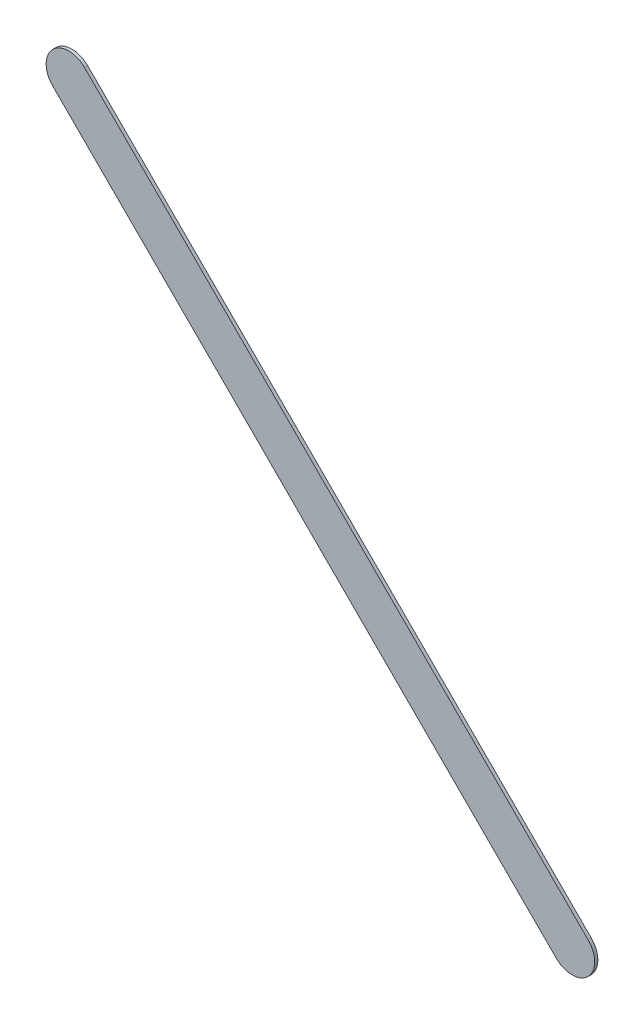
ISO-10303-21;
HEADER;
FILE_DESCRIPTION(('STEP AP214'),'2;1');
FILE_NAME('part.step','',(''),(''),'','','');
FILE_SCHEMA(('AUTOMOTIVE_DESIGN { 1 0 10303 214 1 1 1 1 }'));
ENDSEC;
DATA;
#1=APPLICATION_CONTEXT('core data for automotive mechanical design processes');
#2=APPLICATION_PROTOCOL_DEFINITION('international standard','automotive_design',2000,#1);
#3=PRODUCT_CONTEXT('',#1,'mechanical');
#4=PRODUCT('Part','Part','',(#3));
#5=PRODUCT_RELATED_PRODUCT_CATEGORY('part','',(#4));
#6=PRODUCT_DEFINITION_FORMATION('','',#4);
#7=PRODUCT_DEFINITION_CONTEXT('part definition',#1,'design');
#8=PRODUCT_DEFINITION('design','',#6,#7);
#9=PRODUCT_DEFINITION_SHAPE('','',#8);
#10=(LENGTH_UNIT() NAMED_UNIT(*) SI_UNIT(.MILLI.,.METRE.));
#11=(NAMED_UNIT(*) PLANE_ANGLE_UNIT() SI_UNIT($,.RADIAN.));
#12=(NAMED_UNIT(*) SI_UNIT($,.STERADIAN.) SOLID_ANGLE_UNIT());
#13=UNCERTAINTY_MEASURE_WITH_UNIT(LENGTH_MEASURE(1.E-05),#10,'distance_accuracy_value','');
#14=(GEOMETRIC_REPRESENTATION_CONTEXT(3) GLOBAL_UNCERTAINTY_ASSIGNED_CONTEXT((#13)) GLOBAL_UNIT_ASSIGNED_CONTEXT((#10,
#11,#12)) REPRESENTATION_CONTEXT('',''));
#15=CARTESIAN_POINT('',(0.,0.,0.));
#16=DIRECTION('',(0.,0.,1.));
#17=DIRECTION('',(1.,0.,0.));
#18=AXIS2_PLACEMENT_3D('',#15,#16,#17);
#19=CARTESIAN_POINT('',(158.164776,-89.739223,0.));
#20=DIRECTION('',(0.,0.,1.));
#21=DIRECTION('',(1.,0.,0.));
#22=AXIS2_PLACEMENT_3D('',#19,#20,#21);
#23=PLANE('',#22);
#24=DIRECTION('',(-0.707106781186548,0.707106781186548,0.));
#25=VECTOR('',#24,1.);
#26=CARTESIAN_POINT('',(158.164776,-89.739223,0.));
#27=LINE('',#26,#25);
#28=CARTESIAN_POINT('',(158.164776,-89.739223,0.));
#29=VERTEX_POINT('',#28);
#30=CARTESIAN_POINT('',(152.576776,-84.151223,0.));
#31=VERTEX_POINT('',#30);
#32=EDGE_CURVE('E82',#29,#31,#27,.T.);
#33=ORIENTED_EDGE('',*,*,#32,.T.);
#34=CARTESIAN_POINT('',(152.3999995,-84.3279995,0.));
#35=DIRECTION('',(0.,0.,1.));
#36=DIRECTION('',(0.707106781186548,0.707106781186548,0.));
#37=AXIS2_PLACEMENT_3D('',#34,#35,#36);
#38=CIRCLE('',#37,0.249999723809);
#39=CARTESIAN_POINT('',(152.223223,-84.504776,0.));
#40=VERTEX_POINT('',#39);
#41=EDGE_CURVE('E106',#31,#40,#38,.T.);
#42=ORIENTED_EDGE('',*,*,#41,.T.);
#43=DIRECTION('',(0.707106781186548,-0.707106781186548,0.));
#44=VECTOR('',#43,1.);
#45=CARTESIAN_POINT('',(152.223223,-84.504776,0.));
#46=LINE('',#45,#44);
#47=CARTESIAN_POINT('',(157.811223,-90.092776,0.));
#48=VERTEX_POINT('',#47);
#49=EDGE_CURVE('E74',#40,#48,#46,.T.);
#50=ORIENTED_EDGE('',*,*,#49,.T.);
#51=CARTESIAN_POINT('',(157.9879995,-89.9159995,0.));
#52=DIRECTION('',(0.,0.,1.));
#53=DIRECTION('',(-0.707106781186548,-0.707106781186548,0.));
#54=AXIS2_PLACEMENT_3D('',#51,#52,#53);
#55=CIRCLE('',#54,0.249999723809);
#56=EDGE_CURVE('E11',#48,#29,#55,.T.);
#57=ORIENTED_EDGE('',*,*,#56,.T.);
#58=EDGE_LOOP('',(#33,#42,#50,#57));
#59=FACE_BOUND('',#58,.T.);
#60=ADVANCED_FACE('F17',(#59),#23,.T.);
#61=CARTESIAN_POINT('',(158.164776,-89.739223,-0.035));
#62=DIRECTION('',(0.,0.,1.));
#63=DIRECTION('',(1.,0.,0.));
#64=AXIS2_PLACEMENT_3D('',#61,#62,#63);
#65=PLANE('',#64);
#66=CARTESIAN_POINT('',(157.9879995,-89.9159995,-0.035));
#67=DIRECTION('',(0.,0.,1.));
#68=DIRECTION('',(-0.707106781186548,-0.707106781186548,0.));
#69=AXIS2_PLACEMENT_3D('',#66,#67,#68);
#70=CIRCLE('',#69,0.249999723809);
#71=CARTESIAN_POINT('',(157.811223,-90.092776,-0.035));
#72=VERTEX_POINT('',#71);
#73=CARTESIAN_POINT('',(158.164776,-89.739223,-0.035));
#74=VERTEX_POINT('',#73);
#75=EDGE_CURVE('E25',#72,#74,#70,.T.);
#76=ORIENTED_EDGE('',*,*,#75,.F.);
#77=DIRECTION('',(0.707106781186548,-0.707106781186548,0.));
#78=VECTOR('',#77,1.);
#79=CARTESIAN_POINT('',(152.223223,-84.504776,-0.035));
#80=LINE('',#79,#78);
#81=CARTESIAN_POINT('',(152.223223,-84.504776,-0.035));
#82=VERTEX_POINT('',#81);
#83=EDGE_CURVE('E110',#82,#72,#80,.T.);
#84=ORIENTED_EDGE('',*,*,#83,.F.);
#85=CARTESIAN_POINT('',(152.3999995,-84.3279995,-0.035));
#86=DIRECTION('',(0.,0.,1.));
#87=DIRECTION('',(0.707106781186548,0.707106781186548,0.));
#88=AXIS2_PLACEMENT_3D('',#85,#86,#87);
#89=CIRCLE('',#88,0.249999723809);
#90=CARTESIAN_POINT('',(152.576776,-84.151223,-0.035));
#91=VERTEX_POINT('',#90);
#92=EDGE_CURVE('E84',#91,#82,#89,.T.);
#93=ORIENTED_EDGE('',*,*,#92,.F.);
#94=DIRECTION('',(-0.707106781186548,0.707106781186548,0.));
#95=VECTOR('',#94,1.);
#96=CARTESIAN_POINT('',(158.164776,-89.739223,-0.035));
#97=LINE('',#96,#95);
#98=EDGE_CURVE('E80',#74,#91,#97,.T.);
#99=ORIENTED_EDGE('',*,*,#98,.F.);
#100=EDGE_LOOP('',(#76,#84,#93,#99));
#101=FACE_BOUND('',#100,.T.);
#102=ADVANCED_FACE('F86',(#101),#65,.F.);
#103=CARTESIAN_POINT('',(157.9879995,-89.9159995,-0.035));
#104=DIRECTION('',(0.,0.,-1.));
#105=DIRECTION('',(-0.707106781186548,-0.707106781186548,0.));
#106=AXIS2_PLACEMENT_3D('',#103,#104,#105);
#107=CYLINDRICAL_SURFACE('',#106,0.249999723809);
#108=ORIENTED_EDGE('',*,*,#75,.T.);
#109=DIRECTION('',(0.,0.,1.));
#110=VECTOR('',#109,1.);
#111=CARTESIAN_POINT('',(158.164776,-89.739223,-0.035));
#112=LINE('',#111,#110);
#113=EDGE_CURVE('E68',#74,#29,#112,.T.);
#114=ORIENTED_EDGE('',*,*,#113,.T.);
#115=ORIENTED_EDGE('',*,*,#56,.F.);
#116=DIRECTION('',(0.,0.,1.));
#117=VECTOR('',#116,1.);
#118=CARTESIAN_POINT('',(157.811223,-90.092776,-0.035));
#119=LINE('',#118,#117);
#120=EDGE_CURVE('E71',#72,#48,#119,.T.);
#121=ORIENTED_EDGE('',*,*,#120,.F.);
#122=EDGE_LOOP('',(#108,#114,#115,#121));
#123=FACE_BOUND('',#122,.T.);
#124=ADVANCED_FACE('F67',(#123),#107,.T.);
#125=CARTESIAN_POINT('',(152.223223,-84.504776,-0.035));
#126=DIRECTION('',(0.707106781186548,0.707106781186548,0.));
#127=DIRECTION('',(0.,0.,-1.));
#128=AXIS2_PLACEMENT_3D('',#125,#126,#127);
#129=PLANE('',#128);
#130=ORIENTED_EDGE('',*,*,#83,.T.);
#131=ORIENTED_EDGE('',*,*,#120,.T.);
#132=ORIENTED_EDGE('',*,*,#49,.F.);
#133=DIRECTION('',(0.,0.,1.));
#134=VECTOR('',#133,1.);
#135=CARTESIAN_POINT('',(152.223223,-84.504776,-0.035));
#136=LINE('',#135,#134);
#137=EDGE_CURVE('E102',#82,#40,#136,.T.);
#138=ORIENTED_EDGE('',*,*,#137,.F.);
#139=EDGE_LOOP('',(#130,#131,#132,#138));
#140=FACE_BOUND('',#139,.T.);
#141=ADVANCED_FACE('F120',(#140),#129,.F.);
#142=CARTESIAN_POINT('',(152.3999995,-84.3279995,-0.035));
#143=DIRECTION('',(0.,0.,-1.));
#144=DIRECTION('',(0.707106781186548,0.707106781186548,0.));
#145=AXIS2_PLACEMENT_3D('',#142,#143,#144);
#146=CYLINDRICAL_SURFACE('',#145,0.249999723809);
#147=ORIENTED_EDGE('',*,*,#92,.T.);
#148=ORIENTED_EDGE('',*,*,#137,.T.);
#149=ORIENTED_EDGE('',*,*,#41,.F.);
#150=DIRECTION('',(0.,0.,1.));
#151=VECTOR('',#150,1.);
#152=CARTESIAN_POINT('',(152.576776,-84.151223,-0.035));
#153=LINE('',#152,#151);
#154=EDGE_CURVE('E90',#91,#31,#153,.T.);
#155=ORIENTED_EDGE('',*,*,#154,.F.);
#156=EDGE_LOOP('',(#147,#148,#149,#155));
#157=FACE_BOUND('',#156,.T.);
#158=ADVANCED_FACE('F122',(#157),#146,.T.);
#159=CARTESIAN_POINT('',(158.164776,-89.739223,-0.035));
#160=DIRECTION('',(-0.707106781186548,-0.707106781186548,0.));
#161=DIRECTION('',(-0.707106781186548,0.707106781186548,0.));
#162=AXIS2_PLACEMENT_3D('',#159,#160,#161);
#163=PLANE('',#162);
#164=ORIENTED_EDGE('',*,*,#98,.T.);
#165=ORIENTED_EDGE('',*,*,#154,.T.);
#166=ORIENTED_EDGE('',*,*,#32,.F.);
#167=ORIENTED_EDGE('',*,*,#113,.F.);
#168=EDGE_LOOP('',(#164,#165,#166,#167));
#169=FACE_BOUND('',#168,.T.);
#170=ADVANCED_FACE('F78',(#169),#163,.F.);
#171=CLOSED_SHELL('',(#60,#102,#124,#141,#158,#170));
#172=MANIFOLD_SOLID_BREP('B1',#171);
#173=ADVANCED_BREP_SHAPE_REPRESENTATION('',(#18,#172),#14);
#174=SHAPE_DEFINITION_REPRESENTATION(#9,#173);
ENDSEC;
END-ISO-10303-21;
